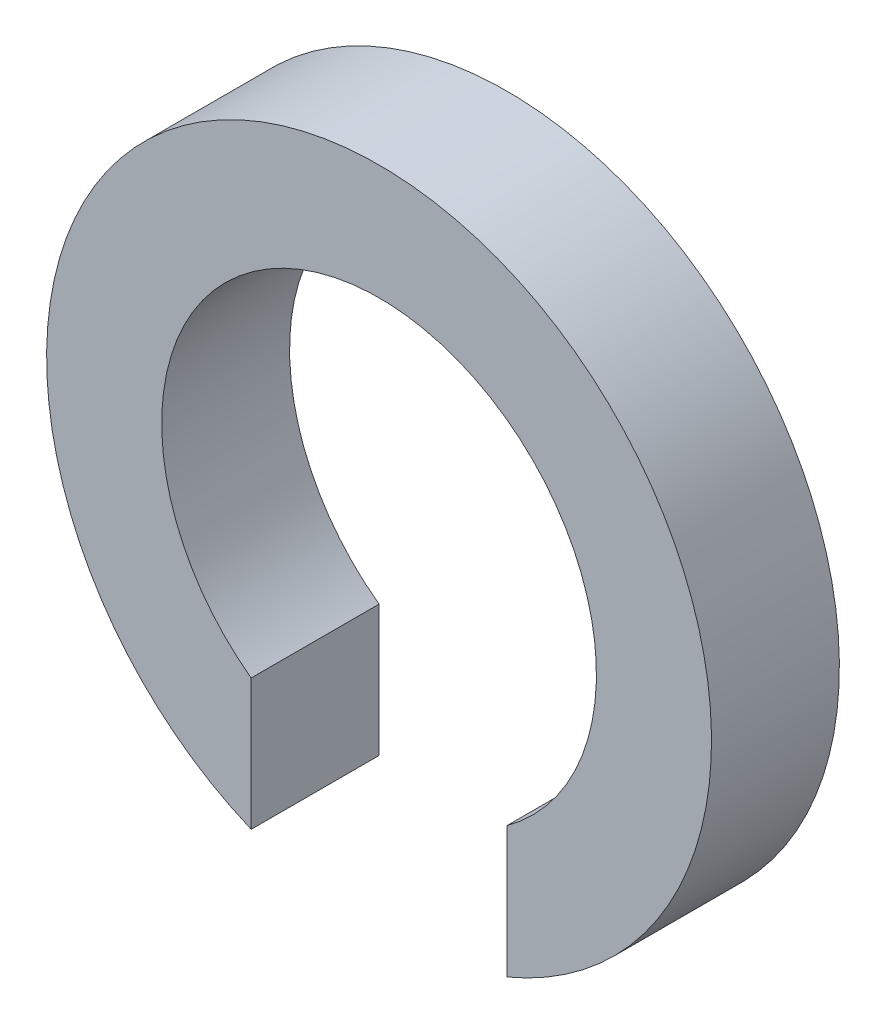
ISO-10303-21;
HEADER;
FILE_DESCRIPTION(('STEP AP214'),'2;1');
FILE_NAME('part.step','',(''),(''),'','','');
FILE_SCHEMA(('AUTOMOTIVE_DESIGN { 1 0 10303 214 1 1 1 1 }'));
ENDSEC;
DATA;
#1=APPLICATION_CONTEXT('core data for automotive mechanical design processes');
#2=APPLICATION_PROTOCOL_DEFINITION('international standard','automotive_design',2000,#1);
#3=PRODUCT_CONTEXT('',#1,'mechanical');
#4=PRODUCT('Part','Part','',(#3));
#5=PRODUCT_RELATED_PRODUCT_CATEGORY('part','',(#4));
#6=PRODUCT_DEFINITION_FORMATION('','',#4);
#7=PRODUCT_DEFINITION_CONTEXT('part definition',#1,'design');
#8=PRODUCT_DEFINITION('design','',#6,#7);
#9=PRODUCT_DEFINITION_SHAPE('','',#8);
#10=(LENGTH_UNIT() NAMED_UNIT(*) SI_UNIT(.MILLI.,.METRE.));
#11=(NAMED_UNIT(*) PLANE_ANGLE_UNIT() SI_UNIT($,.RADIAN.));
#12=(NAMED_UNIT(*) SI_UNIT($,.STERADIAN.) SOLID_ANGLE_UNIT());
#13=UNCERTAINTY_MEASURE_WITH_UNIT(LENGTH_MEASURE(1.E-05),#10,'distance_accuracy_value','');
#14=(GEOMETRIC_REPRESENTATION_CONTEXT(3) GLOBAL_UNCERTAINTY_ASSIGNED_CONTEXT((#13)) GLOBAL_UNIT_ASSIGNED_CONTEXT((#10,
#11,#12)) REPRESENTATION_CONTEXT('',''));
#15=CARTESIAN_POINT('',(0.,0.,0.));
#16=DIRECTION('',(0.,0.,1.));
#17=DIRECTION('',(1.,0.,0.));
#18=AXIS2_PLACEMENT_3D('',#15,#16,#17);
#19=CARTESIAN_POINT('',(-13.524757101,-12.50019026577,6.));
#20=DIRECTION('',(0.,0.,1.));
#21=DIRECTION('',(1.,0.,0.));
#22=AXIS2_PLACEMENT_3D('',#19,#20,#21);
#23=PLANE('',#22);
#24=CARTESIAN_POINT('',(0.,0.,5.99999999999984));
#25=DIRECTION('',(0.,0.,1.));
#26=DIRECTION('',(1.,0.,0.));
#27=AXIS2_PLACEMENT_3D('',#24,#25,#26);
#28=CIRCLE('',#27,13.);
#29=CARTESIAN_POINT('',(4.99999999999729,-12.0000000000011,5.99999999999984));
#30=VERTEX_POINT('',#29);
#31=CARTESIAN_POINT('',(-5.,-11.9999999999994,5.99999999999992));
#32=VERTEX_POINT('',#31);
#33=EDGE_CURVE('E83',#30,#32,#28,.T.);
#34=ORIENTED_EDGE('',*,*,#33,.T.);
#35=DIRECTION('',(0.,-1.,0.));
#36=VECTOR('',#35,1.);
#37=CARTESIAN_POINT('',(-5.,-9.436931771216,6.));
#38=LINE('',#37,#36);
#39=CARTESIAN_POINT('',(-5.,-6.87386354243387,5.99999999999992));
#40=VERTEX_POINT('',#39);
#41=EDGE_CURVE('E58',#40,#32,#38,.T.);
#42=ORIENTED_EDGE('',*,*,#41,.F.);
#43=CARTESIAN_POINT('',(0.,0.,5.99999999999984));
#44=DIRECTION('',(0.,0.,1.));
#45=DIRECTION('',(1.,0.,0.));
#46=AXIS2_PLACEMENT_3D('',#43,#44,#45);
#47=CIRCLE('',#46,8.5);
#48=CARTESIAN_POINT('',(5.,-6.87386354243352,5.99999999999992));
#49=VERTEX_POINT('',#48);
#50=EDGE_CURVE('E20',#49,#40,#47,.T.);
#51=ORIENTED_EDGE('',*,*,#50,.F.);
#52=DIRECTION('',(0.,1.,0.));
#53=VECTOR('',#52,1.);
#54=CARTESIAN_POINT('',(5.,-9.436931771216,6.));
#55=LINE('',#54,#53);
#56=EDGE_CURVE('E56',#30,#49,#55,.T.);
#57=ORIENTED_EDGE('',*,*,#56,.F.);
#58=EDGE_LOOP('',(#34,#42,#51,#57));
#59=FACE_BOUND('',#58,.T.);
#60=ADVANCED_FACE('F16',(#59),#23,.T.);
#61=CARTESIAN_POINT('',(0.,0.,1.));
#62=DIRECTION('',(0.,0.,1.));
#63=DIRECTION('',(1.,0.,0.));
#64=AXIS2_PLACEMENT_3D('',#61,#62,#63);
#65=CYLINDRICAL_SURFACE('',#64,8.5);
#66=ORIENTED_EDGE('',*,*,#50,.T.);
#67=DIRECTION('',(0.,0.,1.));
#68=VECTOR('',#67,1.);
#69=CARTESIAN_POINT('',(-5.,-6.87386354243398,3.5));
#70=LINE('',#69,#68);
#71=CARTESIAN_POINT('',(-5.,-6.87386354243387,1.));
#72=VERTEX_POINT('',#71);
#73=EDGE_CURVE('E78',#72,#40,#70,.T.);
#74=ORIENTED_EDGE('',*,*,#73,.F.);
#75=CARTESIAN_POINT('',(0.,0.,1.));
#76=DIRECTION('',(0.,0.,1.));
#77=DIRECTION('',(1.,0.,0.));
#78=AXIS2_PLACEMENT_3D('',#75,#76,#77);
#79=CIRCLE('',#78,8.5);
#80=CARTESIAN_POINT('',(5.,-6.87386354243352,1.));
#81=VERTEX_POINT('',#80);
#82=EDGE_CURVE('E73',#72,#81,#79,.F.);
#83=ORIENTED_EDGE('',*,*,#82,.T.);
#84=DIRECTION('',(0.,0.,-1.));
#85=VECTOR('',#84,1.);
#86=CARTESIAN_POINT('',(5.,-6.87386354243328,3.5));
#87=LINE('',#86,#85);
#88=EDGE_CURVE('E63',#49,#81,#87,.T.);
#89=ORIENTED_EDGE('',*,*,#88,.F.);
#90=EDGE_LOOP('',(#66,#74,#83,#89));
#91=FACE_BOUND('',#90,.T.);
#92=ADVANCED_FACE('F72',(#91),#65,.F.);
#93=CARTESIAN_POINT('',(5.,-6.771340813282,0.9));
#94=DIRECTION('',(-1.,0.,0.));
#95=DIRECTION('',(0.,-1.,0.));
#96=AXIS2_PLACEMENT_3D('',#93,#94,#95);
#97=PLANE('',#96);
#98=DIRECTION('',(0.,0.,1.));
#99=VECTOR('',#98,1.);
#100=CARTESIAN_POINT('',(4.99999999999458,-12.0000000000023,3.5));
#101=LINE('',#100,#99);
#102=CARTESIAN_POINT('',(4.99999999999729,-12.0000000000011,1.));
#103=VERTEX_POINT('',#102);
#104=EDGE_CURVE('E69',#103,#30,#101,.T.);
#105=ORIENTED_EDGE('',*,*,#104,.T.);
#106=ORIENTED_EDGE('',*,*,#56,.T.);
#107=ORIENTED_EDGE('',*,*,#88,.T.);
#108=DIRECTION('',(0.,-1.,0.));
#109=VECTOR('',#108,1.);
#110=CARTESIAN_POINT('',(5.,0.504756644195,1.));
#111=LINE('',#110,#109);
#112=EDGE_CURVE('E82',#81,#103,#111,.T.);
#113=ORIENTED_EDGE('',*,*,#112,.T.);
#114=EDGE_LOOP('',(#105,#106,#107,#113));
#115=FACE_BOUND('',#114,.T.);
#116=ADVANCED_FACE('F66',(#115),#97,.T.);
#117=CARTESIAN_POINT('',(0.,0.,1.));
#118=DIRECTION('',(0.,0.,1.));
#119=DIRECTION('',(1.,0.,0.));
#120=AXIS2_PLACEMENT_3D('',#117,#118,#119);
#121=CYLINDRICAL_SURFACE('',#120,13.);
#122=ORIENTED_EDGE('',*,*,#33,.F.);
#123=ORIENTED_EDGE('',*,*,#104,.F.);
#124=CARTESIAN_POINT('',(0.,0.,1.));
#125=DIRECTION('',(0.,0.,1.));
#126=DIRECTION('',(1.,0.,0.));
#127=AXIS2_PLACEMENT_3D('',#124,#125,#126);
#128=CIRCLE('',#127,13.);
#129=CARTESIAN_POINT('',(-5.,-11.9999999999994,1.));
#130=VERTEX_POINT('',#129);
#131=EDGE_CURVE('E26',#103,#130,#128,.T.);
#132=ORIENTED_EDGE('',*,*,#131,.T.);
#133=DIRECTION('',(0.,0.,-1.));
#134=VECTOR('',#133,1.);
#135=CARTESIAN_POINT('',(-5.,-11.9999999999987,3.5));
#136=LINE('',#135,#134);
#137=EDGE_CURVE('E34',#32,#130,#136,.T.);
#138=ORIENTED_EDGE('',*,*,#137,.F.);
#139=EDGE_LOOP('',(#122,#123,#132,#138));
#140=FACE_BOUND('',#139,.T.);
#141=ADVANCED_FACE('F89',(#140),#121,.T.);
#142=CARTESIAN_POINT('',(-5.,-12.10252272915,0.9));
#143=DIRECTION('',(1.,0.,0.));
#144=DIRECTION('',(0.,1.,0.));
#145=AXIS2_PLACEMENT_3D('',#142,#143,#144);
#146=PLANE('',#145);
#147=ORIENTED_EDGE('',*,*,#137,.T.);
#148=DIRECTION('',(0.,1.,0.));
#149=VECTOR('',#148,1.);
#150=CARTESIAN_POINT('',(-5.,0.504756644195,1.));
#151=LINE('',#150,#149);
#152=EDGE_CURVE('E11',#130,#72,#151,.T.);
#153=ORIENTED_EDGE('',*,*,#152,.T.);
#154=ORIENTED_EDGE('',*,*,#73,.T.);
#155=ORIENTED_EDGE('',*,*,#41,.T.);
#156=EDGE_LOOP('',(#147,#153,#154,#155));
#157=FACE_BOUND('',#156,.T.);
#158=ADVANCED_FACE('F91',(#157),#146,.T.);
#159=CARTESIAN_POINT('',(-13.524757101,-12.50019026577,1.));
#160=DIRECTION('',(0.,0.,1.));
#161=DIRECTION('',(1.,0.,0.));
#162=AXIS2_PLACEMENT_3D('',#159,#160,#161);
#163=PLANE('',#162);
#164=ORIENTED_EDGE('',*,*,#131,.F.);
#165=ORIENTED_EDGE('',*,*,#112,.F.);
#166=ORIENTED_EDGE('',*,*,#82,.F.);
#167=ORIENTED_EDGE('',*,*,#152,.F.);
#168=EDGE_LOOP('',(#164,#165,#166,#167));
#169=FACE_BOUND('',#168,.T.);
#170=ADVANCED_FACE('F18',(#169),#163,.F.);
#171=CLOSED_SHELL('',(#60,#92,#116,#141,#158,#170));
#172=MANIFOLD_SOLID_BREP('B1',#171);
#173=ADVANCED_BREP_SHAPE_REPRESENTATION('',(#18,#172),#14);
#174=SHAPE_DEFINITION_REPRESENTATION(#9,#173);
ENDSEC;
END-ISO-10303-21;
